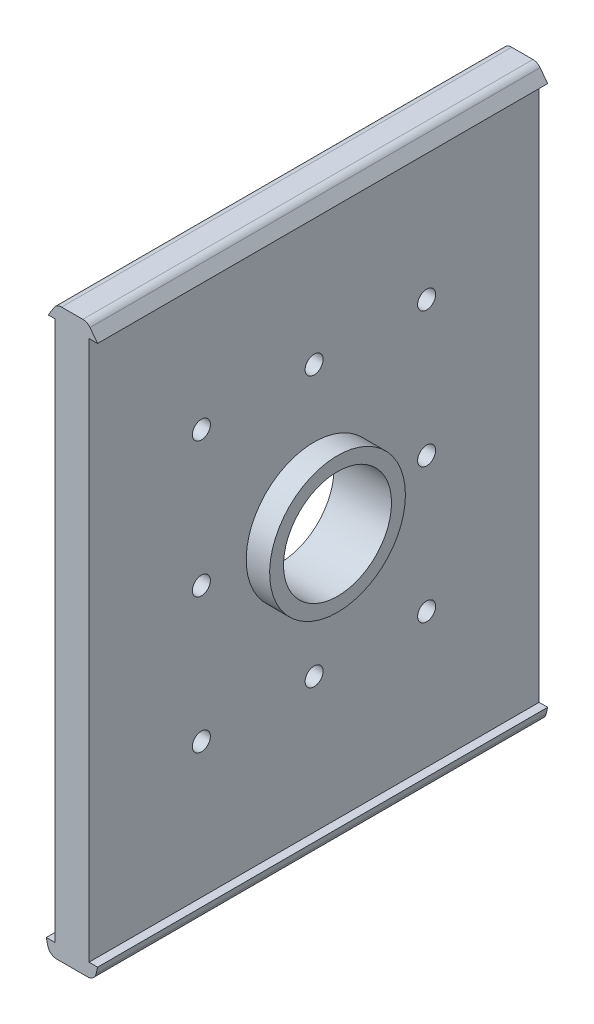
ISO-10303-21;
HEADER;
FILE_DESCRIPTION(('STEP AP214'),'2;1');
FILE_NAME('part.step','',(''),(''),'','','');
FILE_SCHEMA(('AUTOMOTIVE_DESIGN { 1 0 10303 214 1 1 1 1 }'));
ENDSEC;
DATA;
#1=APPLICATION_CONTEXT('core data for automotive mechanical design processes');
#2=APPLICATION_PROTOCOL_DEFINITION('international standard','automotive_design',2000,#1);
#3=PRODUCT_CONTEXT('',#1,'mechanical');
#4=PRODUCT('Part','Part','',(#3));
#5=PRODUCT_RELATED_PRODUCT_CATEGORY('part','',(#4));
#6=PRODUCT_DEFINITION_FORMATION('','',#4);
#7=PRODUCT_DEFINITION_CONTEXT('part definition',#1,'design');
#8=PRODUCT_DEFINITION('design','',#6,#7);
#9=PRODUCT_DEFINITION_SHAPE('','',#8);
#10=(LENGTH_UNIT() NAMED_UNIT(*) SI_UNIT(.MILLI.,.METRE.));
#11=(NAMED_UNIT(*) PLANE_ANGLE_UNIT() SI_UNIT($,.RADIAN.));
#12=(NAMED_UNIT(*) SI_UNIT($,.STERADIAN.) SOLID_ANGLE_UNIT());
#13=UNCERTAINTY_MEASURE_WITH_UNIT(LENGTH_MEASURE(1.E-05),#10,'distance_accuracy_value','');
#14=(GEOMETRIC_REPRESENTATION_CONTEXT(3) GLOBAL_UNCERTAINTY_ASSIGNED_CONTEXT((#13)) GLOBAL_UNIT_ASSIGNED_CONTEXT((#10,
#11,#12)) REPRESENTATION_CONTEXT('',''));
#15=CARTESIAN_POINT('',(0.,0.,0.));
#16=DIRECTION('',(0.,0.,1.));
#17=DIRECTION('',(1.,0.,0.));
#18=AXIS2_PLACEMENT_3D('',#15,#16,#17);
#19=CARTESIAN_POINT('',(3.8,0.,160.));
#20=DIRECTION('',(-1.,0.,0.));
#21=DIRECTION('',(0.,-1.,0.));
#22=AXIS2_PLACEMENT_3D('',#19,#20,#21);
#23=PLANE('',#22);
#24=CARTESIAN_POINT('',(3.8,-8.17862465898205,105.042568922673));
#25=DIRECTION('',(1.,0.,0.));
#26=DIRECTION('',(0.,0.,-1.));
#27=AXIS2_PLACEMENT_3D('',#24,#25,#26);
#28=CIRCLE('',#27,2.);
#29=CARTESIAN_POINT('',(3.8,-8.17862465898205,103.042568922673));
#30=VERTEX_POINT('',#29);
#31=EDGE_CURVE('E279',#30,#30,#28,.T.);
#32=ORIENTED_EDGE('',*,*,#31,.F.);
#33=EDGE_LOOP('',(#32));
#34=FACE_BOUND('',#33,.T.);
#35=CARTESIAN_POINT('',(3.80000000000002,-68.178624658982,105.042568922673));
#36=DIRECTION('',(1.,0.,0.));
#37=DIRECTION('',(0.,0.,-1.));
#38=AXIS2_PLACEMENT_3D('',#35,#36,#37);
#39=CIRCLE('',#38,2.);
#40=CARTESIAN_POINT('',(3.80000000000002,-68.178624658982,103.042568922673));
#41=VERTEX_POINT('',#40);
#42=EDGE_CURVE('E291',#41,#41,#39,.T.);
#43=ORIENTED_EDGE('',*,*,#42,.F.);
#44=EDGE_LOOP('',(#43));
#45=FACE_BOUND('',#44,.T.);
#46=CARTESIAN_POINT('',(3.80000000000001,-38.178624658982,55.));
#47=DIRECTION('',(1.,0.,0.));
#48=DIRECTION('',(0.,0.,-1.));
#49=AXIS2_PLACEMENT_3D('',#46,#47,#48);
#50=CIRCLE('',#49,2.);
#51=CARTESIAN_POINT('',(3.80000000000001,-38.178624658982,53.));
#52=VERTEX_POINT('',#51);
#53=EDGE_CURVE('E303',#52,#52,#50,.T.);
#54=ORIENTED_EDGE('',*,*,#53,.F.);
#55=EDGE_LOOP('',(#54));
#56=FACE_BOUND('',#55,.T.);
#57=CARTESIAN_POINT('',(3.80000000000002,-68.178624658982,80.));
#58=DIRECTION('',(1.,0.,0.));
#59=DIRECTION('',(0.,0.,-1.));
#60=AXIS2_PLACEMENT_3D('',#57,#58,#59);
#61=CIRCLE('',#60,2.);
#62=CARTESIAN_POINT('',(3.80000000000002,-68.178624658982,78.));
#63=VERTEX_POINT('',#62);
#64=EDGE_CURVE('E315',#63,#63,#61,.T.);
#65=ORIENTED_EDGE('',*,*,#64,.F.);
#66=EDGE_LOOP('',(#65));
#67=FACE_BOUND('',#66,.T.);
#68=DIRECTION('',(0.,0.,-1.));
#69=VECTOR('',#68,1.);
#70=CARTESIAN_POINT('',(3.8,21.821375341018,160.));
#71=LINE('',#70,#69);
#72=CARTESIAN_POINT('',(3.8,21.821375341018,130.));
#73=VERTEX_POINT('',#72);
#74=CARTESIAN_POINT('',(3.8,21.821375341018,30.));
#75=VERTEX_POINT('',#74);
#76=EDGE_CURVE('E190',#73,#75,#71,.T.);
#77=ORIENTED_EDGE('',*,*,#76,.F.);
#78=DIRECTION('',(0.,1.,0.));
#79=VECTOR('',#78,1.);
#80=CARTESIAN_POINT('',(3.80000000000002,21.821375341018,130.));
#81=LINE('',#80,#79);
#82=CARTESIAN_POINT('',(3.80000000000002,-98.178624658982,130.));
#83=VERTEX_POINT('',#82);
#84=EDGE_CURVE('E327',#83,#73,#81,.T.);
#85=ORIENTED_EDGE('',*,*,#84,.F.);
#86=DIRECTION('',(0.,0.,-1.));
#87=VECTOR('',#86,1.);
#88=CARTESIAN_POINT('',(3.80000000000002,-98.178624658982,160.));
#89=LINE('',#88,#87);
#90=CARTESIAN_POINT('',(3.80000000000002,-98.178624658982,30.));
#91=VERTEX_POINT('',#90);
#92=EDGE_CURVE('E199',#83,#91,#89,.T.);
#93=ORIENTED_EDGE('',*,*,#92,.T.);
#94=DIRECTION('',(0.,1.,0.));
#95=VECTOR('',#94,1.);
#96=CARTESIAN_POINT('',(3.80000000000002,21.821375341018,30.));
#97=LINE('',#96,#95);
#98=EDGE_CURVE('E340',#91,#75,#97,.T.);
#99=ORIENTED_EDGE('',*,*,#98,.T.);
#100=EDGE_LOOP('',(#77,#85,#93,#99));
#101=FACE_BOUND('',#100,.T.);
#102=CARTESIAN_POINT('',(3.8,-8.17862465898205,80.));
#103=DIRECTION('',(1.,0.,0.));
#104=DIRECTION('',(0.,0.,-1.));
#105=AXIS2_PLACEMENT_3D('',#102,#103,#104);
#106=CIRCLE('',#105,2.);
#107=CARTESIAN_POINT('',(3.8,-8.17862465898205,78.));
#108=VERTEX_POINT('',#107);
#109=EDGE_CURVE('E321',#108,#108,#106,.T.);
#110=ORIENTED_EDGE('',*,*,#109,.F.);
#111=EDGE_LOOP('',(#110));
#112=FACE_BOUND('',#111,.T.);
#113=CARTESIAN_POINT('',(3.80000000000002,-68.178624658982,55.));
#114=DIRECTION('',(1.,0.,0.));
#115=DIRECTION('',(0.,0.,-1.));
#116=AXIS2_PLACEMENT_3D('',#113,#114,#115);
#117=CIRCLE('',#116,2.);
#118=CARTESIAN_POINT('',(3.80000000000002,-68.178624658982,53.));
#119=VERTEX_POINT('',#118);
#120=EDGE_CURVE('E309',#119,#119,#117,.T.);
#121=ORIENTED_EDGE('',*,*,#120,.F.);
#122=EDGE_LOOP('',(#121));
#123=FACE_BOUND('',#122,.T.);
#124=CARTESIAN_POINT('',(3.8,-8.17862465898205,55.));
#125=DIRECTION('',(1.,0.,0.));
#126=DIRECTION('',(0.,0.,-1.));
#127=AXIS2_PLACEMENT_3D('',#124,#125,#126);
#128=CIRCLE('',#127,2.);
#129=CARTESIAN_POINT('',(3.8,-8.17862465898205,53.));
#130=VERTEX_POINT('',#129);
#131=EDGE_CURVE('E297',#130,#130,#128,.T.);
#132=ORIENTED_EDGE('',*,*,#131,.F.);
#133=EDGE_LOOP('',(#132));
#134=FACE_BOUND('',#133,.T.);
#135=CARTESIAN_POINT('',(3.80000000000001,-38.178624658982,105.042568922673));
#136=DIRECTION('',(1.,0.,0.));
#137=DIRECTION('',(0.,0.,-1.));
#138=AXIS2_PLACEMENT_3D('',#135,#136,#137);
#139=CIRCLE('',#138,2.);
#140=CARTESIAN_POINT('',(3.80000000000001,-38.178624658982,103.042568922673));
#141=VERTEX_POINT('',#140);
#142=EDGE_CURVE('E285',#141,#141,#139,.T.);
#143=ORIENTED_EDGE('',*,*,#142,.F.);
#144=EDGE_LOOP('',(#143));
#145=FACE_BOUND('',#144,.T.);
#146=CARTESIAN_POINT('',(3.80000000000001,-38.178624658982,80.));
#147=DIRECTION('',(-1.,0.,0.));
#148=DIRECTION('',(0.,-1.,0.));
#149=AXIS2_PLACEMENT_3D('',#146,#147,#148);
#150=CIRCLE('',#149,15.0846684131133);
#151=CARTESIAN_POINT('',(3.80000000000001,-53.2632930720953,80.));
#152=VERTEX_POINT('',#151);
#153=EDGE_CURVE('E12',#152,#152,#150,.F.);
#154=ORIENTED_EDGE('',*,*,#153,.F.);
#155=EDGE_LOOP('',(#154));
#156=FACE_BOUND('',#155,.T.);
#157=ADVANCED_FACE('F45',(#34,#45,#56,#67,#101,#112,#123,#134,#145,#156),#23,.F.);
#158=CARTESIAN_POINT('',(-7.17106379094956E-13,-98.178624658982,160.));
#159=DIRECTION('',(0.,1.,0.));
#160=DIRECTION('',(-1.,0.,0.));
#161=AXIS2_PLACEMENT_3D('',#158,#159,#160);
#162=PLANE('',#161);
#163=DIRECTION('',(1.,0.,0.));
#164=VECTOR('',#163,1.);
#165=CARTESIAN_POINT('',(-7.17106379094956E-13,-98.178624658982,30.));
#166=LINE('',#165,#164);
#167=CARTESIAN_POINT('',(-5.69999999999999,-98.178624658982,30.));
#168=VERTEX_POINT('',#167);
#169=CARTESIAN_POINT('',(-3.79999999999998,-98.178624658982,30.));
#170=VERTEX_POINT('',#169);
#171=EDGE_CURVE('E245',#168,#170,#166,.T.);
#172=ORIENTED_EDGE('',*,*,#171,.F.);
#173=DIRECTION('',(0.,0.,-1.));
#174=VECTOR('',#173,1.);
#175=CARTESIAN_POINT('',(-5.69999999999999,-98.178624658982,160.));
#176=LINE('',#175,#174);
#177=CARTESIAN_POINT('',(-5.69999999999999,-98.178624658982,130.));
#178=VERTEX_POINT('',#177);
#179=EDGE_CURVE('E212',#178,#168,#176,.T.);
#180=ORIENTED_EDGE('',*,*,#179,.F.);
#181=DIRECTION('',(-1.,0.,0.));
#182=VECTOR('',#181,1.);
#183=CARTESIAN_POINT('',(-7.17106379094956E-13,-98.178624658982,130.));
#184=LINE('',#183,#182);
#185=CARTESIAN_POINT('',(-3.8,-98.178624658982,130.));
#186=VERTEX_POINT('',#185);
#187=EDGE_CURVE('E264',#186,#178,#184,.T.);
#188=ORIENTED_EDGE('',*,*,#187,.F.);
#189=DIRECTION('',(0.,0.,-1.));
#190=VECTOR('',#189,1.);
#191=CARTESIAN_POINT('',(-3.79999999999998,-98.178624658982,160.));
#192=LINE('',#191,#190);
#193=EDGE_CURVE('E206',#186,#170,#192,.T.);
#194=ORIENTED_EDGE('',*,*,#193,.T.);
#195=EDGE_LOOP('',(#172,#180,#188,#194));
#196=FACE_BOUND('',#195,.T.);
#197=ADVANCED_FACE('F357',(#196),#162,.T.);
#198=CARTESIAN_POINT('',(0.,21.821375341018,160.));
#199=DIRECTION('',(0.,-1.,0.));
#200=DIRECTION('',(0.,0.,-1.));
#201=AXIS2_PLACEMENT_3D('',#198,#199,#200);
#202=PLANE('',#201);
#203=DIRECTION('',(-1.,0.,0.));
#204=VECTOR('',#203,1.);
#205=CARTESIAN_POINT('',(0.,21.821375341018,30.));
#206=LINE('',#205,#204);
#207=CARTESIAN_POINT('',(5.70000000000001,21.821375341018,30.));
#208=VERTEX_POINT('',#207);
#209=EDGE_CURVE('E381',#208,#75,#206,.T.);
#210=ORIENTED_EDGE('',*,*,#209,.F.);
#211=DIRECTION('',(0.,0.,-1.));
#212=VECTOR('',#211,1.);
#213=CARTESIAN_POINT('',(5.70000000000001,21.821375341018,160.));
#214=LINE('',#213,#212);
#215=CARTESIAN_POINT('',(5.70000000000001,21.821375341018,130.));
#216=VERTEX_POINT('',#215);
#217=EDGE_CURVE('E187',#216,#208,#214,.T.);
#218=ORIENTED_EDGE('',*,*,#217,.F.);
#219=DIRECTION('',(1.,0.,0.));
#220=VECTOR('',#219,1.);
#221=CARTESIAN_POINT('',(0.,21.821375341018,130.));
#222=LINE('',#221,#220);
#223=EDGE_CURVE('E270',#73,#216,#222,.T.);
#224=ORIENTED_EDGE('',*,*,#223,.F.);
#225=ORIENTED_EDGE('',*,*,#76,.T.);
#226=EDGE_LOOP('',(#210,#218,#224,#225));
#227=FACE_BOUND('',#226,.T.);
#228=ADVANCED_FACE('F379',(#227),#202,.T.);
#229=CARTESIAN_POINT('',(-3.8,0.,160.));
#230=DIRECTION('',(-1.,0.,0.));
#231=DIRECTION('',(0.,-1.,0.));
#232=AXIS2_PLACEMENT_3D('',#229,#230,#231);
#233=PLANE('',#232);
#234=CARTESIAN_POINT('',(-3.79999999999999,-38.178624658982,80.));
#235=DIRECTION('',(-1.,0.,0.));
#236=DIRECTION('',(0.,-1.,0.));
#237=AXIS2_PLACEMENT_3D('',#234,#235,#236);
#238=CIRCLE('',#237,12.);
#239=CARTESIAN_POINT('',(-3.79999999999999,-50.178624658982,80.));
#240=VERTEX_POINT('',#239);
#241=EDGE_CURVE('E174',#240,#240,#238,.T.);
#242=ORIENTED_EDGE('',*,*,#241,.F.);
#243=EDGE_LOOP('',(#242));
#244=FACE_BOUND('',#243,.T.);
#245=CARTESIAN_POINT('',(-3.79999999999999,-38.178624658982,105.042568922673));
#246=DIRECTION('',(-1.,0.,0.));
#247=DIRECTION('',(0.,-1.,0.));
#248=AXIS2_PLACEMENT_3D('',#245,#246,#247);
#249=CIRCLE('',#248,2.);
#250=CARTESIAN_POINT('',(-3.79999999999999,-40.178624658982,105.042568922673));
#251=VERTEX_POINT('',#250);
#252=EDGE_CURVE('E288',#251,#251,#249,.F.);
#253=ORIENTED_EDGE('',*,*,#252,.T.);
#254=EDGE_LOOP('',(#253));
#255=FACE_BOUND('',#254,.T.);
#256=CARTESIAN_POINT('',(-3.79999999999999,-8.17862465898205,55.));
#257=DIRECTION('',(-1.,0.,0.));
#258=DIRECTION('',(0.,-1.,0.));
#259=AXIS2_PLACEMENT_3D('',#256,#257,#258);
#260=CIRCLE('',#259,2.);
#261=CARTESIAN_POINT('',(-3.79999999999999,-10.178624658982,55.));
#262=VERTEX_POINT('',#261);
#263=EDGE_CURVE('E300',#262,#262,#260,.F.);
#264=ORIENTED_EDGE('',*,*,#263,.T.);
#265=EDGE_LOOP('',(#264));
#266=FACE_BOUND('',#265,.T.);
#267=CARTESIAN_POINT('',(-3.79999999999999,-68.178624658982,55.));
#268=DIRECTION('',(-1.,0.,0.));
#269=DIRECTION('',(0.,-1.,0.));
#270=AXIS2_PLACEMENT_3D('',#267,#268,#269);
#271=CIRCLE('',#270,2.);
#272=CARTESIAN_POINT('',(-3.79999999999999,-70.178624658982,55.));
#273=VERTEX_POINT('',#272);
#274=EDGE_CURVE('E312',#273,#273,#271,.F.);
#275=ORIENTED_EDGE('',*,*,#274,.T.);
#276=EDGE_LOOP('',(#275));
#277=FACE_BOUND('',#276,.T.);
#278=CARTESIAN_POINT('',(-3.79999999999999,-8.17862465898205,80.));
#279=DIRECTION('',(-1.,0.,0.));
#280=DIRECTION('',(0.,-1.,0.));
#281=AXIS2_PLACEMENT_3D('',#278,#279,#280);
#282=CIRCLE('',#281,2.);
#283=CARTESIAN_POINT('',(-3.79999999999999,-10.178624658982,80.));
#284=VERTEX_POINT('',#283);
#285=EDGE_CURVE('E324',#284,#284,#282,.F.);
#286=ORIENTED_EDGE('',*,*,#285,.T.);
#287=EDGE_LOOP('',(#286));
#288=FACE_BOUND('',#287,.T.);
#289=DIRECTION('',(0.,-1.,0.));
#290=VECTOR('',#289,1.);
#291=CARTESIAN_POINT('',(-3.8,21.821375341018,130.));
#292=LINE('',#291,#290);
#293=CARTESIAN_POINT('',(-3.8,21.821375341018,130.));
#294=VERTEX_POINT('',#293);
#295=EDGE_CURVE('E328',#294,#186,#292,.T.);
#296=ORIENTED_EDGE('',*,*,#295,.F.);
#297=DIRECTION('',(0.,0.,-1.));
#298=VECTOR('',#297,1.);
#299=CARTESIAN_POINT('',(-3.8,21.821375341018,160.));
#300=LINE('',#299,#298);
#301=CARTESIAN_POINT('',(-3.8,21.821375341018,30.));
#302=VERTEX_POINT('',#301);
#303=EDGE_CURVE('E202',#294,#302,#300,.T.);
#304=ORIENTED_EDGE('',*,*,#303,.T.);
#305=DIRECTION('',(0.,-1.,0.));
#306=VECTOR('',#305,1.);
#307=CARTESIAN_POINT('',(-3.8,21.821375341018,30.));
#308=LINE('',#307,#306);
#309=EDGE_CURVE('E331',#302,#170,#308,.T.);
#310=ORIENTED_EDGE('',*,*,#309,.T.);
#311=ORIENTED_EDGE('',*,*,#193,.F.);
#312=EDGE_LOOP('',(#296,#304,#310,#311));
#313=FACE_BOUND('',#312,.T.);
#314=CARTESIAN_POINT('',(-3.79999999999999,-68.178624658982,80.));
#315=DIRECTION('',(-1.,0.,0.));
#316=DIRECTION('',(0.,-1.,0.));
#317=AXIS2_PLACEMENT_3D('',#314,#315,#316);
#318=CIRCLE('',#317,2.);
#319=CARTESIAN_POINT('',(-3.79999999999999,-70.178624658982,80.));
#320=VERTEX_POINT('',#319);
#321=EDGE_CURVE('E318',#320,#320,#318,.F.);
#322=ORIENTED_EDGE('',*,*,#321,.T.);
#323=EDGE_LOOP('',(#322));
#324=FACE_BOUND('',#323,.T.);
#325=CARTESIAN_POINT('',(-3.79999999999999,-38.178624658982,55.));
#326=DIRECTION('',(-1.,0.,0.));
#327=DIRECTION('',(0.,-1.,0.));
#328=AXIS2_PLACEMENT_3D('',#325,#326,#327);
#329=CIRCLE('',#328,2.);
#330=CARTESIAN_POINT('',(-3.79999999999999,-40.178624658982,55.));
#331=VERTEX_POINT('',#330);
#332=EDGE_CURVE('E306',#331,#331,#329,.F.);
#333=ORIENTED_EDGE('',*,*,#332,.T.);
#334=EDGE_LOOP('',(#333));
#335=FACE_BOUND('',#334,.T.);
#336=CARTESIAN_POINT('',(-3.79999999999999,-68.178624658982,105.042568922673));
#337=DIRECTION('',(-1.,0.,0.));
#338=DIRECTION('',(0.,-1.,0.));
#339=AXIS2_PLACEMENT_3D('',#336,#337,#338);
#340=CIRCLE('',#339,2.);
#341=CARTESIAN_POINT('',(-3.79999999999999,-70.178624658982,105.042568922673));
#342=VERTEX_POINT('',#341);
#343=EDGE_CURVE('E294',#342,#342,#340,.F.);
#344=ORIENTED_EDGE('',*,*,#343,.T.);
#345=EDGE_LOOP('',(#344));
#346=FACE_BOUND('',#345,.T.);
#347=CARTESIAN_POINT('',(-3.79999999999999,-8.17862465898205,105.042568922673));
#348=DIRECTION('',(-1.,0.,0.));
#349=DIRECTION('',(0.,-1.,0.));
#350=AXIS2_PLACEMENT_3D('',#347,#348,#349);
#351=CIRCLE('',#350,2.);
#352=CARTESIAN_POINT('',(-3.79999999999999,-10.178624658982,105.042568922673));
#353=VERTEX_POINT('',#352);
#354=EDGE_CURVE('E282',#353,#353,#351,.F.);
#355=ORIENTED_EDGE('',*,*,#354,.T.);
#356=EDGE_LOOP('',(#355));
#357=FACE_BOUND('',#356,.T.);
#358=ADVANCED_FACE('F47',(#244,#255,#266,#277,#288,#313,#324,#335,#346,#357),#233,.T.);
#359=CARTESIAN_POINT('',(-27.1312025062026,-6.33061391811397,160.));
#360=DIRECTION('',(-0.973841209741793,-0.227229615606419,0.));
#361=DIRECTION('',(0.227229615606419,-0.973841209741793,0.));
#362=AXIS2_PLACEMENT_3D('',#359,#360,#361);
#363=PLANE('',#362);
#364=DIRECTION('',(-0.227229615606419,0.973841209741793,0.));
#365=VECTOR('',#364,1.);
#366=CARTESIAN_POINT('',(-27.1312025062026,-6.33061391811397,30.));
#367=LINE('',#366,#365);
#368=CARTESIAN_POINT('',(-5.36062617938365,-99.6330838901949,30.));
#369=VERTEX_POINT('',#368);
#370=EDGE_CURVE('E257',#369,#168,#367,.T.);
#371=ORIENTED_EDGE('',*,*,#370,.F.);
#372=DIRECTION('',(0.,0.,-1.));
#373=VECTOR('',#372,1.);
#374=CARTESIAN_POINT('',(-5.36062617938366,-99.6330838901949,160.));
#375=LINE('',#374,#373);
#376=CARTESIAN_POINT('',(-5.36062617938366,-99.6330838901949,130.));
#377=VERTEX_POINT('',#376);
#378=EDGE_CURVE('E217',#377,#369,#375,.T.);
#379=ORIENTED_EDGE('',*,*,#378,.F.);
#380=DIRECTION('',(0.227229615606419,-0.973841209741793,0.));
#381=VECTOR('',#380,1.);
#382=CARTESIAN_POINT('',(-27.1312025062026,-6.33061391811397,130.));
#383=LINE('',#382,#381);
#384=EDGE_CURVE('E360',#178,#377,#383,.T.);
#385=ORIENTED_EDGE('',*,*,#384,.F.);
#386=ORIENTED_EDGE('',*,*,#179,.T.);
#387=EDGE_LOOP('',(#371,#379,#385,#386));
#388=FACE_BOUND('',#387,.T.);
#389=ADVANCED_FACE('F442',(#388),#363,.T.);
#390=CARTESIAN_POINT('',(-3.41294375990007,-99.178624658982,160.));
#391=DIRECTION('',(0.,0.,-1.));
#392=DIRECTION('',(-1.,0.,0.));
#393=AXIS2_PLACEMENT_3D('',#390,#391,#392);
#394=CYLINDRICAL_SURFACE('',#393,2.);
#395=ORIENTED_EDGE('',*,*,#378,.T.);
#396=CARTESIAN_POINT('',(-3.41294375990007,-99.178624658982,30.));
#397=DIRECTION('',(0.,0.,1.));
#398=DIRECTION('',(1.,0.,0.));
#399=AXIS2_PLACEMENT_3D('',#396,#397,#398);
#400=CIRCLE('',#399,2.);
#401=CARTESIAN_POINT('',(-3.41294375990007,-101.178624658982,30.));
#402=VERTEX_POINT('',#401);
#403=EDGE_CURVE('E254',#369,#402,#400,.T.);
#404=ORIENTED_EDGE('',*,*,#403,.T.);
#405=DIRECTION('',(0.,0.,-1.));
#406=VECTOR('',#405,1.);
#407=CARTESIAN_POINT('',(-3.41294375990007,-101.178624658982,160.));
#408=LINE('',#407,#406);
#409=CARTESIAN_POINT('',(-3.41294375990007,-101.178624658982,130.));
#410=VERTEX_POINT('',#409);
#411=EDGE_CURVE('E220',#410,#402,#408,.T.);
#412=ORIENTED_EDGE('',*,*,#411,.F.);
#413=CARTESIAN_POINT('',(-3.41294375990007,-99.178624658982,130.));
#414=DIRECTION('',(0.,0.,-1.));
#415=DIRECTION('',(-1.,0.,0.));
#416=AXIS2_PLACEMENT_3D('',#413,#414,#415);
#417=CIRCLE('',#416,2.);
#418=EDGE_CURVE('E361',#410,#377,#417,.T.);
#419=ORIENTED_EDGE('',*,*,#418,.T.);
#420=EDGE_LOOP('',(#395,#404,#412,#419));
#421=FACE_BOUND('',#420,.T.);
#422=ADVANCED_FACE('F439',(#421),#394,.T.);
#423=CARTESIAN_POINT('',(0.,-101.178624658982,160.));
#424=DIRECTION('',(0.,1.,0.));
#425=DIRECTION('',(0.,0.,1.));
#426=AXIS2_PLACEMENT_3D('',#423,#424,#425);
#427=PLANE('',#426);
#428=ORIENTED_EDGE('',*,*,#411,.T.);
#429=DIRECTION('',(1.,0.,0.));
#430=VECTOR('',#429,1.);
#431=CARTESIAN_POINT('',(0.,-101.178624658982,30.));
#432=LINE('',#431,#430);
#433=CARTESIAN_POINT('',(3.4129437599001,-101.178624658982,30.));
#434=VERTEX_POINT('',#433);
#435=EDGE_CURVE('E247',#402,#434,#432,.T.);
#436=ORIENTED_EDGE('',*,*,#435,.T.);
#437=DIRECTION('',(0.,0.,-1.));
#438=VECTOR('',#437,1.);
#439=CARTESIAN_POINT('',(3.4129437599001,-101.178624658982,160.));
#440=LINE('',#439,#438);
#441=CARTESIAN_POINT('',(3.4129437599001,-101.178624658982,130.));
#442=VERTEX_POINT('',#441);
#443=EDGE_CURVE('E223',#442,#434,#440,.T.);
#444=ORIENTED_EDGE('',*,*,#443,.F.);
#445=DIRECTION('',(-1.,0.,0.));
#446=VECTOR('',#445,1.);
#447=CARTESIAN_POINT('',(0.,-101.178624658982,130.));
#448=LINE('',#447,#446);
#449=EDGE_CURVE('E364',#442,#410,#448,.T.);
#450=ORIENTED_EDGE('',*,*,#449,.T.);
#451=EDGE_LOOP('',(#428,#436,#444,#450));
#452=FACE_BOUND('',#451,.T.);
#453=ADVANCED_FACE('F435',(#452),#427,.F.);
#454=CARTESIAN_POINT('',(3.4129437599001,-99.178624658982,160.));
#455=DIRECTION('',(0.,0.,-1.));
#456=DIRECTION('',(-1.,0.,0.));
#457=AXIS2_PLACEMENT_3D('',#454,#455,#456);
#458=CYLINDRICAL_SURFACE('',#457,2.);
#459=ORIENTED_EDGE('',*,*,#443,.T.);
#460=CARTESIAN_POINT('',(3.4129437599001,-99.178624658982,30.));
#461=DIRECTION('',(0.,0.,1.));
#462=DIRECTION('',(1.,0.,0.));
#463=AXIS2_PLACEMENT_3D('',#460,#461,#462);
#464=CIRCLE('',#463,2.);
#465=CARTESIAN_POINT('',(5.3606261793837,-99.6330838901949,30.));
#466=VERTEX_POINT('',#465);
#467=EDGE_CURVE('E244',#434,#466,#464,.T.);
#468=ORIENTED_EDGE('',*,*,#467,.T.);
#469=DIRECTION('',(0.,0.,-1.));
#470=VECTOR('',#469,1.);
#471=CARTESIAN_POINT('',(5.3606261793837,-99.6330838901949,160.));
#472=LINE('',#471,#470);
#473=CARTESIAN_POINT('',(5.36062617938369,-99.6330838901949,130.));
#474=VERTEX_POINT('',#473);
#475=EDGE_CURVE('E226',#474,#466,#472,.T.);
#476=ORIENTED_EDGE('',*,*,#475,.F.);
#477=CARTESIAN_POINT('',(3.4129437599001,-99.178624658982,130.));
#478=DIRECTION('',(0.,0.,-1.));
#479=DIRECTION('',(-1.,0.,0.));
#480=AXIS2_PLACEMENT_3D('',#477,#478,#479);
#481=CIRCLE('',#480,2.);
#482=EDGE_CURVE('E370',#474,#442,#481,.T.);
#483=ORIENTED_EDGE('',*,*,#482,.T.);
#484=EDGE_LOOP('',(#459,#468,#476,#483));
#485=FACE_BOUND('',#484,.T.);
#486=ADVANCED_FACE('F432',(#485),#458,.T.);
#487=CARTESIAN_POINT('',(27.1312025062019,-6.33061391811356,160.));
#488=DIRECTION('',(0.973841209741795,-0.227229615606411,0.));
#489=DIRECTION('',(0.227229615606411,0.973841209741795,0.));
#490=AXIS2_PLACEMENT_3D('',#487,#488,#489);
#491=PLANE('',#490);
#492=DIRECTION('',(-0.227229615606411,-0.973841209741795,0.));
#493=VECTOR('',#492,1.);
#494=CARTESIAN_POINT('',(27.1312025062019,-6.33061391811356,30.));
#495=LINE('',#494,#493);
#496=CARTESIAN_POINT('',(5.70000000000001,-98.1786246589821,30.));
#497=VERTEX_POINT('',#496);
#498=EDGE_CURVE('E242',#497,#466,#495,.T.);
#499=ORIENTED_EDGE('',*,*,#498,.F.);
#500=DIRECTION('',(0.,0.,-1.));
#501=VECTOR('',#500,1.);
#502=CARTESIAN_POINT('',(5.70000000000001,-98.1786246589821,160.));
#503=LINE('',#502,#501);
#504=CARTESIAN_POINT('',(5.70000000000001,-98.1786246589821,130.));
#505=VERTEX_POINT('',#504);
#506=EDGE_CURVE('E209',#505,#497,#503,.T.);
#507=ORIENTED_EDGE('',*,*,#506,.F.);
#508=DIRECTION('',(0.227229615606411,0.973841209741795,0.));
#509=VECTOR('',#508,1.);
#510=CARTESIAN_POINT('',(27.1312025062019,-6.33061391811356,130.));
#511=LINE('',#510,#509);
#512=EDGE_CURVE('E240',#474,#505,#511,.T.);
#513=ORIENTED_EDGE('',*,*,#512,.F.);
#514=ORIENTED_EDGE('',*,*,#475,.T.);
#515=EDGE_LOOP('',(#499,#507,#513,#514));
#516=FACE_BOUND('',#515,.T.);
#517=ADVANCED_FACE('F239',(#516),#491,.T.);
#518=EDGE_CURVE('E234',#91,#497,#166,.T.);
#519=ORIENTED_EDGE('',*,*,#518,.F.);
#520=ORIENTED_EDGE('',*,*,#92,.F.);
#521=EDGE_CURVE('E235',#505,#83,#184,.T.);
#522=ORIENTED_EDGE('',*,*,#521,.F.);
#523=ORIENTED_EDGE('',*,*,#506,.T.);
#524=EDGE_LOOP('',(#519,#520,#522,#523));
#525=FACE_BOUND('',#524,.T.);
#526=ADVANCED_FACE('F232',(#525),#162,.T.);
#527=CARTESIAN_POINT('',(-5.26679924331625,21.821375341018,30.));
#528=VERTEX_POINT('',#527);
#529=EDGE_CURVE('E60',#302,#528,#206,.T.);
#530=ORIENTED_EDGE('',*,*,#529,.F.);
#531=ORIENTED_EDGE('',*,*,#303,.F.);
#532=CARTESIAN_POINT('',(-5.26679924331625,21.821375341018,130.));
#533=VERTEX_POINT('',#532);
#534=EDGE_CURVE('E262',#533,#294,#222,.T.);
#535=ORIENTED_EDGE('',*,*,#534,.F.);
#536=DIRECTION('',(0.,0.,-1.));
#537=VECTOR('',#536,1.);
#538=CARTESIAN_POINT('',(-5.26679924331625,21.821375341018,160.));
#539=LINE('',#538,#537);
#540=EDGE_CURVE('E181',#533,#528,#539,.T.);
#541=ORIENTED_EDGE('',*,*,#540,.T.);
#542=EDGE_LOOP('',(#530,#531,#535,#541));
#543=FACE_BOUND('',#542,.T.);
#544=ADVANCED_FACE('F346',(#543),#202,.T.);
#545=CARTESIAN_POINT('',(14.1258813531818,10.7688950319018,160.));
#546=DIRECTION('',(-0.795260200775992,-0.606268268229279,0.));
#547=DIRECTION('',(0.606268268229279,-0.795260200775992,0.));
#548=AXIS2_PLACEMENT_3D('',#545,#546,#547);
#549=PLANE('',#548);
#550=ORIENTED_EDGE('',*,*,#217,.T.);
#551=DIRECTION('',(-0.606268268229279,0.795260200775992,0.));
#552=VECTOR('',#551,1.);
#553=CARTESIAN_POINT('',(14.1258813531818,10.7688950319018,30.));
#554=LINE('',#553,#552);
#555=CARTESIAN_POINT('',(4.01326816928115,24.0339118774765,30.));
#556=VERTEX_POINT('',#555);
#557=EDGE_CURVE('E387',#208,#556,#554,.T.);
#558=ORIENTED_EDGE('',*,*,#557,.T.);
#559=DIRECTION('',(0.,0.,-1.));
#560=VECTOR('',#559,1.);
#561=CARTESIAN_POINT('',(4.01326816928115,24.0339118774765,160.));
#562=LINE('',#561,#560);
#563=CARTESIAN_POINT('',(4.01326816928115,24.0339118774765,130.));
#564=VERTEX_POINT('',#563);
#565=EDGE_CURVE('E179',#564,#556,#562,.T.);
#566=ORIENTED_EDGE('',*,*,#565,.F.);
#567=DIRECTION('',(0.606268268229279,-0.795260200775992,0.));
#568=VECTOR('',#567,1.);
#569=CARTESIAN_POINT('',(14.1258813531818,10.7688950319018,130.));
#570=LINE('',#569,#568);
#571=EDGE_CURVE('E273',#564,#216,#570,.T.);
#572=ORIENTED_EDGE('',*,*,#571,.T.);
#573=EDGE_LOOP('',(#550,#558,#566,#572));
#574=FACE_BOUND('',#573,.T.);
#575=ADVANCED_FACE('F385',(#574),#549,.F.);
#576=CARTESIAN_POINT('',(2.42274776772917,22.8213753410179,160.));
#577=DIRECTION('',(0.,0.,-1.));
#578=DIRECTION('',(-1.,0.,0.));
#579=AXIS2_PLACEMENT_3D('',#576,#577,#578);
#580=CYLINDRICAL_SURFACE('',#579,2.);
#581=CARTESIAN_POINT('',(2.42274776772917,22.8213753410179,30.));
#582=DIRECTION('',(0.,0.,1.));
#583=DIRECTION('',(1.,0.,0.));
#584=AXIS2_PLACEMENT_3D('',#581,#582,#583);
#585=CIRCLE('',#584,2.);
#586=CARTESIAN_POINT('',(2.42274776772917,24.821375341018,30.));
#587=VERTEX_POINT('',#586);
#588=EDGE_CURVE('E390',#587,#556,#585,.F.);
#589=ORIENTED_EDGE('',*,*,#588,.F.);
#590=DIRECTION('',(0.,0.,-1.));
#591=VECTOR('',#590,1.);
#592=CARTESIAN_POINT('',(2.42274776772917,24.821375341018,160.));
#593=LINE('',#592,#591);
#594=CARTESIAN_POINT('',(2.42274776772917,24.821375341018,130.));
#595=VERTEX_POINT('',#594);
#596=EDGE_CURVE('E173',#595,#587,#593,.T.);
#597=ORIENTED_EDGE('',*,*,#596,.F.);
#598=CARTESIAN_POINT('',(2.42274776772917,22.8213753410179,130.));
#599=DIRECTION('',(0.,0.,-1.));
#600=DIRECTION('',(-1.,0.,0.));
#601=AXIS2_PLACEMENT_3D('',#598,#599,#600);
#602=CIRCLE('',#601,2.);
#603=EDGE_CURVE('E277',#564,#595,#602,.F.);
#604=ORIENTED_EDGE('',*,*,#603,.F.);
#605=ORIENTED_EDGE('',*,*,#565,.T.);
#606=EDGE_LOOP('',(#589,#597,#604,#605));
#607=FACE_BOUND('',#606,.T.);
#608=ADVANCED_FACE('F389',(#607),#580,.T.);
#609=CARTESIAN_POINT('',(0.,24.821375341018,160.));
#610=DIRECTION('',(0.,-1.,0.));
#611=DIRECTION('',(1.,0.,0.));
#612=AXIS2_PLACEMENT_3D('',#609,#610,#611);
#613=PLANE('',#612);
#614=ORIENTED_EDGE('',*,*,#596,.T.);
#615=DIRECTION('',(1.,0.,0.));
#616=VECTOR('',#615,1.);
#617=CARTESIAN_POINT('',(-38.,24.821375341018,30.));
#618=LINE('',#617,#616);
#619=CARTESIAN_POINT('',(-2.29779279131515,24.821375341018,30.));
#620=VERTEX_POINT('',#619);
#621=EDGE_CURVE('E159',#620,#587,#618,.T.);
#622=ORIENTED_EDGE('',*,*,#621,.F.);
#623=DIRECTION('',(0.,0.,-1.));
#624=VECTOR('',#623,1.);
#625=CARTESIAN_POINT('',(-2.29779279131514,24.821375341018,160.));
#626=LINE('',#625,#624);
#627=CARTESIAN_POINT('',(-2.29779279131515,24.821375341018,130.));
#628=VERTEX_POINT('',#627);
#629=EDGE_CURVE('E171',#628,#620,#626,.T.);
#630=ORIENTED_EDGE('',*,*,#629,.F.);
#631=DIRECTION('',(1.,0.,0.));
#632=VECTOR('',#631,1.);
#633=CARTESIAN_POINT('',(-38.,24.821375341018,130.));
#634=LINE('',#633,#632);
#635=EDGE_CURVE('E259',#628,#595,#634,.T.);
#636=ORIENTED_EDGE('',*,*,#635,.T.);
#637=EDGE_LOOP('',(#614,#622,#630,#636));
#638=FACE_BOUND('',#637,.T.);
#639=ADVANCED_FACE('F169',(#638),#613,.F.);
#640=CARTESIAN_POINT('',(-2.29779279131514,22.8213753410179,160.));
#641=DIRECTION('',(0.,0.,-1.));
#642=DIRECTION('',(-1.,0.,0.));
#643=AXIS2_PLACEMENT_3D('',#640,#641,#642);
#644=CYLINDRICAL_SURFACE('',#643,2.);
#645=ORIENTED_EDGE('',*,*,#629,.T.);
#646=CARTESIAN_POINT('',(-2.29779279131514,22.8213753410179,30.));
#647=DIRECTION('',(0.,0.,1.));
#648=DIRECTION('',(1.,0.,0.));
#649=AXIS2_PLACEMENT_3D('',#646,#647,#648);
#650=CIRCLE('',#649,2.);
#651=CARTESIAN_POINT('',(-3.99915691907052,23.8727364135269,30.));
#652=VERTEX_POINT('',#651);
#653=EDGE_CURVE('E156',#620,#652,#650,.T.);
#654=ORIENTED_EDGE('',*,*,#653,.T.);
#655=DIRECTION('',(0.,0.,-1.));
#656=VECTOR('',#655,1.);
#657=CARTESIAN_POINT('',(-3.99915691907052,23.8727364135269,160.));
#658=LINE('',#657,#656);
#659=CARTESIAN_POINT('',(-3.99915691907052,23.8727364135269,130.));
#660=VERTEX_POINT('',#659);
#661=EDGE_CURVE('E177',#660,#652,#658,.T.);
#662=ORIENTED_EDGE('',*,*,#661,.F.);
#663=CARTESIAN_POINT('',(-2.29779279131514,22.8213753410179,130.));
#664=DIRECTION('',(0.,0.,-1.));
#665=DIRECTION('',(-1.,0.,0.));
#666=AXIS2_PLACEMENT_3D('',#663,#664,#665);
#667=CIRCLE('',#666,2.);
#668=EDGE_CURVE('E68',#660,#628,#667,.T.);
#669=ORIENTED_EDGE('',*,*,#668,.T.);
#670=EDGE_LOOP('',(#645,#654,#662,#669));
#671=FACE_BOUND('',#670,.T.);
#672=ADVANCED_FACE('F176',(#671),#644,.T.);
#673=CARTESIAN_POINT('',(-13.5696072539082,8.38536360515385,160.));
#674=DIRECTION('',(0.850682063877688,-0.52568053625448,0.));
#675=DIRECTION('',(0.52568053625448,0.850682063877688,0.));
#676=AXIS2_PLACEMENT_3D('',#673,#674,#675);
#677=PLANE('',#676);
#678=ORIENTED_EDGE('',*,*,#661,.T.);
#679=DIRECTION('',(-0.52568053625448,-0.850682063877688,0.));
#680=VECTOR('',#679,1.);
#681=CARTESIAN_POINT('',(-13.5696072539082,8.38536360515385,30.));
#682=LINE('',#681,#680);
#683=EDGE_CURVE('E53',#652,#528,#682,.T.);
#684=ORIENTED_EDGE('',*,*,#683,.T.);
#685=ORIENTED_EDGE('',*,*,#540,.F.);
#686=DIRECTION('',(0.52568053625448,0.850682063877688,0.));
#687=VECTOR('',#686,1.);
#688=CARTESIAN_POINT('',(-13.5696072539082,8.38536360515385,130.));
#689=LINE('',#688,#687);
#690=EDGE_CURVE('E205',#533,#660,#689,.T.);
#691=ORIENTED_EDGE('',*,*,#690,.T.);
#692=EDGE_LOOP('',(#678,#684,#685,#691));
#693=FACE_BOUND('',#692,.T.);
#694=ADVANCED_FACE('F349',(#693),#677,.F.);
#695=CARTESIAN_POINT('',(0.,0.,30.));
#696=DIRECTION('',(0.,0.,1.));
#697=DIRECTION('',(1.,0.,0.));
#698=AXIS2_PLACEMENT_3D('',#695,#696,#697);
#699=PLANE('',#698);
#700=ORIENTED_EDGE('',*,*,#309,.F.);
#701=ORIENTED_EDGE('',*,*,#529,.T.);
#702=ORIENTED_EDGE('',*,*,#683,.F.);
#703=ORIENTED_EDGE('',*,*,#653,.F.);
#704=ORIENTED_EDGE('',*,*,#621,.T.);
#705=ORIENTED_EDGE('',*,*,#588,.T.);
#706=ORIENTED_EDGE('',*,*,#557,.F.);
#707=ORIENTED_EDGE('',*,*,#209,.T.);
#708=ORIENTED_EDGE('',*,*,#98,.F.);
#709=ORIENTED_EDGE('',*,*,#518,.T.);
#710=ORIENTED_EDGE('',*,*,#498,.T.);
#711=ORIENTED_EDGE('',*,*,#467,.F.);
#712=ORIENTED_EDGE('',*,*,#435,.F.);
#713=ORIENTED_EDGE('',*,*,#403,.F.);
#714=ORIENTED_EDGE('',*,*,#370,.T.);
#715=ORIENTED_EDGE('',*,*,#171,.T.);
#716=EDGE_LOOP('',(#700,#701,#702,#703,#704,#705,#706,#707,#708,#709,#710,#711,#712,#713,#714,#715));
#717=FACE_BOUND('',#716,.T.);
#718=ADVANCED_FACE('F158',(#717),#699,.F.);
#719=CARTESIAN_POINT('',(0.,0.,130.));
#720=DIRECTION('',(0.,0.,-1.));
#721=DIRECTION('',(-1.,0.,0.));
#722=AXIS2_PLACEMENT_3D('',#719,#720,#721);
#723=PLANE('',#722);
#724=ORIENTED_EDGE('',*,*,#295,.T.);
#725=ORIENTED_EDGE('',*,*,#187,.T.);
#726=ORIENTED_EDGE('',*,*,#384,.T.);
#727=ORIENTED_EDGE('',*,*,#418,.F.);
#728=ORIENTED_EDGE('',*,*,#449,.F.);
#729=ORIENTED_EDGE('',*,*,#482,.F.);
#730=ORIENTED_EDGE('',*,*,#512,.T.);
#731=ORIENTED_EDGE('',*,*,#521,.T.);
#732=ORIENTED_EDGE('',*,*,#84,.T.);
#733=ORIENTED_EDGE('',*,*,#223,.T.);
#734=ORIENTED_EDGE('',*,*,#571,.F.);
#735=ORIENTED_EDGE('',*,*,#603,.T.);
#736=ORIENTED_EDGE('',*,*,#635,.F.);
#737=ORIENTED_EDGE('',*,*,#668,.F.);
#738=ORIENTED_EDGE('',*,*,#690,.F.);
#739=ORIENTED_EDGE('',*,*,#534,.T.);
#740=EDGE_LOOP('',(#724,#725,#726,#727,#728,#729,#730,#731,#732,#733,#734,#735,#736,#737,#738,#739));
#741=FACE_BOUND('',#740,.T.);
#742=ADVANCED_FACE('F350',(#741),#723,.F.);
#743=CARTESIAN_POINT('',(3.8,-8.17862465898205,80.));
#744=DIRECTION('',(-1.,0.,0.));
#745=DIRECTION('',(0.,-1.,0.));
#746=AXIS2_PLACEMENT_3D('',#743,#744,#745);
#747=CYLINDRICAL_SURFACE('',#746,2.);
#748=ORIENTED_EDGE('',*,*,#285,.F.);
#749=EDGE_LOOP('',(#748));
#750=FACE_BOUND('',#749,.T.);
#751=ORIENTED_EDGE('',*,*,#109,.T.);
#752=EDGE_LOOP('',(#751));
#753=FACE_BOUND('',#752,.T.);
#754=ADVANCED_FACE('F467',(#750,#753),#747,.F.);
#755=CARTESIAN_POINT('',(3.80000000000002,-68.178624658982,80.));
#756=DIRECTION('',(-1.,0.,0.));
#757=DIRECTION('',(0.,-1.,0.));
#758=AXIS2_PLACEMENT_3D('',#755,#756,#757);
#759=CYLINDRICAL_SURFACE('',#758,2.);
#760=ORIENTED_EDGE('',*,*,#321,.F.);
#761=EDGE_LOOP('',(#760));
#762=FACE_BOUND('',#761,.T.);
#763=ORIENTED_EDGE('',*,*,#64,.T.);
#764=EDGE_LOOP('',(#763));
#765=FACE_BOUND('',#764,.T.);
#766=ADVANCED_FACE('F470',(#762,#765),#759,.F.);
#767=CARTESIAN_POINT('',(3.80000000000002,-68.178624658982,55.));
#768=DIRECTION('',(-1.,0.,0.));
#769=DIRECTION('',(0.,-1.,0.));
#770=AXIS2_PLACEMENT_3D('',#767,#768,#769);
#771=CYLINDRICAL_SURFACE('',#770,2.);
#772=ORIENTED_EDGE('',*,*,#274,.F.);
#773=EDGE_LOOP('',(#772));
#774=FACE_BOUND('',#773,.T.);
#775=ORIENTED_EDGE('',*,*,#120,.T.);
#776=EDGE_LOOP('',(#775));
#777=FACE_BOUND('',#776,.T.);
#778=ADVANCED_FACE('F506',(#774,#777),#771,.F.);
#779=CARTESIAN_POINT('',(3.80000000000001,-38.178624658982,55.));
#780=DIRECTION('',(-1.,0.,0.));
#781=DIRECTION('',(0.,-1.,0.));
#782=AXIS2_PLACEMENT_3D('',#779,#780,#781);
#783=CYLINDRICAL_SURFACE('',#782,2.);
#784=ORIENTED_EDGE('',*,*,#332,.F.);
#785=EDGE_LOOP('',(#784));
#786=FACE_BOUND('',#785,.T.);
#787=ORIENTED_EDGE('',*,*,#53,.T.);
#788=EDGE_LOOP('',(#787));
#789=FACE_BOUND('',#788,.T.);
#790=ADVANCED_FACE('F502',(#786,#789),#783,.F.);
#791=CARTESIAN_POINT('',(3.8,-8.17862465898205,55.));
#792=DIRECTION('',(-1.,0.,0.));
#793=DIRECTION('',(0.,-1.,0.));
#794=AXIS2_PLACEMENT_3D('',#791,#792,#793);
#795=CYLINDRICAL_SURFACE('',#794,2.);
#796=ORIENTED_EDGE('',*,*,#263,.F.);
#797=EDGE_LOOP('',(#796));
#798=FACE_BOUND('',#797,.T.);
#799=ORIENTED_EDGE('',*,*,#131,.T.);
#800=EDGE_LOOP('',(#799));
#801=FACE_BOUND('',#800,.T.);
#802=ADVANCED_FACE('F495',(#798,#801),#795,.F.);
#803=CARTESIAN_POINT('',(3.80000000000002,-68.178624658982,105.042568922673));
#804=DIRECTION('',(-1.,0.,0.));
#805=DIRECTION('',(0.,-1.,0.));
#806=AXIS2_PLACEMENT_3D('',#803,#804,#805);
#807=CYLINDRICAL_SURFACE('',#806,2.);
#808=ORIENTED_EDGE('',*,*,#343,.F.);
#809=EDGE_LOOP('',(#808));
#810=FACE_BOUND('',#809,.T.);
#811=ORIENTED_EDGE('',*,*,#42,.T.);
#812=EDGE_LOOP('',(#811));
#813=FACE_BOUND('',#812,.T.);
#814=ADVANCED_FACE('F486',(#810,#813),#807,.F.);
#815=CARTESIAN_POINT('',(3.80000000000001,-38.178624658982,105.042568922673));
#816=DIRECTION('',(-1.,0.,0.));
#817=DIRECTION('',(0.,-1.,0.));
#818=AXIS2_PLACEMENT_3D('',#815,#816,#817);
#819=CYLINDRICAL_SURFACE('',#818,2.);
#820=ORIENTED_EDGE('',*,*,#252,.F.);
#821=EDGE_LOOP('',(#820));
#822=FACE_BOUND('',#821,.T.);
#823=ORIENTED_EDGE('',*,*,#142,.T.);
#824=EDGE_LOOP('',(#823));
#825=FACE_BOUND('',#824,.T.);
#826=ADVANCED_FACE('F483',(#822,#825),#819,.F.);
#827=CARTESIAN_POINT('',(3.8,-8.17862465898205,105.042568922673));
#828=DIRECTION('',(-1.,0.,0.));
#829=DIRECTION('',(0.,-1.,0.));
#830=AXIS2_PLACEMENT_3D('',#827,#828,#829);
#831=CYLINDRICAL_SURFACE('',#830,2.);
#832=ORIENTED_EDGE('',*,*,#354,.F.);
#833=EDGE_LOOP('',(#832));
#834=FACE_BOUND('',#833,.T.);
#835=ORIENTED_EDGE('',*,*,#31,.T.);
#836=EDGE_LOOP('',(#835));
#837=FACE_BOUND('',#836,.T.);
#838=ADVANCED_FACE('F485',(#834,#837),#831,.F.);
#839=CARTESIAN_POINT('',(-54.,-38.178624658982,80.));
#840=DIRECTION('',(1.,0.,0.));
#841=DIRECTION('',(0.,0.,-1.));
#842=AXIS2_PLACEMENT_3D('',#839,#840,#841);
#843=CYLINDRICAL_SURFACE('',#842,12.);
#844=ORIENTED_EDGE('',*,*,#241,.T.);
#845=EDGE_LOOP('',(#844));
#846=FACE_BOUND('',#845,.T.);
#847=CARTESIAN_POINT('',(9.,-38.178624658982,80.));
#848=DIRECTION('',(1.,0.,0.));
#849=DIRECTION('',(0.,0.,-1.));
#850=AXIS2_PLACEMENT_3D('',#847,#848,#849);
#851=CIRCLE('',#850,12.);
#852=CARTESIAN_POINT('',(9.,-38.178624658982,68.));
#853=VERTEX_POINT('',#852);
#854=EDGE_CURVE('E399',#853,#853,#851,.T.);
#855=ORIENTED_EDGE('',*,*,#854,.T.);
#856=EDGE_LOOP('',(#855));
#857=FACE_BOUND('',#856,.T.);
#858=ADVANCED_FACE('F403',(#846,#857),#843,.F.);
#859=CARTESIAN_POINT('',(9.,-38.178624658982,80.));
#860=DIRECTION('',(-1.,0.,0.));
#861=DIRECTION('',(0.,0.,1.));
#862=AXIS2_PLACEMENT_3D('',#859,#860,#861);
#863=CYLINDRICAL_SURFACE('',#862,15.0846684131133);
#864=CARTESIAN_POINT('',(9.,-38.178624658982,80.));
#865=DIRECTION('',(1.,0.,0.));
#866=DIRECTION('',(0.,0.,-1.));
#867=AXIS2_PLACEMENT_3D('',#864,#865,#866);
#868=CIRCLE('',#867,15.0846684131133);
#869=CARTESIAN_POINT('',(9.,-38.178624658982,64.9153315868867));
#870=VERTEX_POINT('',#869);
#871=EDGE_CURVE('E396',#870,#870,#868,.T.);
#872=ORIENTED_EDGE('',*,*,#871,.F.);
#873=EDGE_LOOP('',(#872));
#874=FACE_BOUND('',#873,.T.);
#875=ORIENTED_EDGE('',*,*,#153,.T.);
#876=EDGE_LOOP('',(#875));
#877=FACE_BOUND('',#876,.T.);
#878=ADVANCED_FACE('F407',(#874,#877),#863,.T.);
#879=CARTESIAN_POINT('',(9.,-38.178624658982,80.));
#880=DIRECTION('',(1.,0.,0.));
#881=DIRECTION('',(0.,0.,-1.));
#882=AXIS2_PLACEMENT_3D('',#879,#880,#881);
#883=PLANE('',#882);
#884=ORIENTED_EDGE('',*,*,#871,.T.);
#885=EDGE_LOOP('',(#884));
#886=FACE_BOUND('',#885,.T.);
#887=ORIENTED_EDGE('',*,*,#854,.F.);
#888=EDGE_LOOP('',(#887));
#889=FACE_BOUND('',#888,.T.);
#890=ADVANCED_FACE('F405',(#886,#889),#883,.T.);
#891=CLOSED_SHELL('',(#157,#197,#228,#358,#389,#422,#453,#486,#517,#526,#544,#575,#608,#639,
#672,#694,#718,#742,#754,#766,#778,#790,#802,#814,#826,#838,#858,#878,#890));
#892=MANIFOLD_SOLID_BREP('B2',#891);
#893=ADVANCED_BREP_SHAPE_REPRESENTATION('',(#18,#892),#14);
#894=SHAPE_DEFINITION_REPRESENTATION(#9,#893);
ENDSEC;
END-ISO-10303-21;
